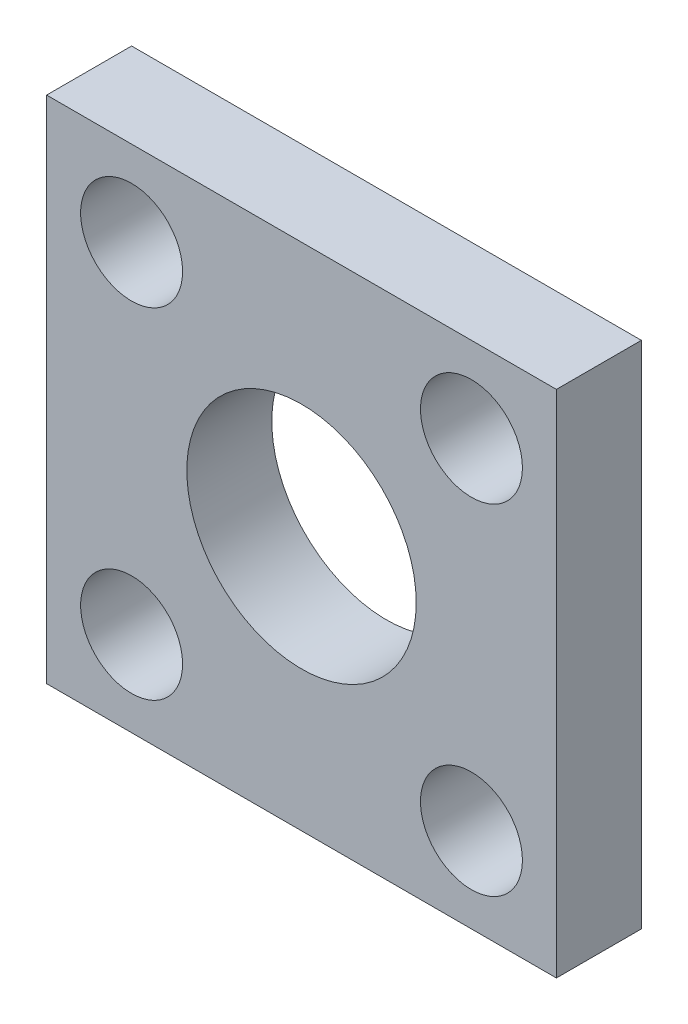
ISO-10303-21;
HEADER;
FILE_DESCRIPTION(('STEP AP214'),'2;1');
FILE_NAME('part.step','',(''),(''),'','','');
FILE_SCHEMA(('AUTOMOTIVE_DESIGN { 1 0 10303 214 1 1 1 1 }'));
ENDSEC;
DATA;
#1=APPLICATION_CONTEXT('core data for automotive mechanical design processes');
#2=APPLICATION_PROTOCOL_DEFINITION('international standard','automotive_design',2000,#1);
#3=PRODUCT_CONTEXT('',#1,'mechanical');
#4=PRODUCT('Part','Part','',(#3));
#5=PRODUCT_RELATED_PRODUCT_CATEGORY('part','',(#4));
#6=PRODUCT_DEFINITION_FORMATION('','',#4);
#7=PRODUCT_DEFINITION_CONTEXT('part definition',#1,'design');
#8=PRODUCT_DEFINITION('design','',#6,#7);
#9=PRODUCT_DEFINITION_SHAPE('','',#8);
#10=(LENGTH_UNIT() NAMED_UNIT(*) SI_UNIT(.MILLI.,.METRE.));
#11=(NAMED_UNIT(*) PLANE_ANGLE_UNIT() SI_UNIT($,.RADIAN.));
#12=(NAMED_UNIT(*) SI_UNIT($,.STERADIAN.) SOLID_ANGLE_UNIT());
#13=UNCERTAINTY_MEASURE_WITH_UNIT(LENGTH_MEASURE(1.E-05),#10,'distance_accuracy_value','');
#14=(GEOMETRIC_REPRESENTATION_CONTEXT(3) GLOBAL_UNCERTAINTY_ASSIGNED_CONTEXT((#13)) GLOBAL_UNIT_ASSIGNED_CONTEXT((#10,
#11,#12)) REPRESENTATION_CONTEXT('',''));
#15=CARTESIAN_POINT('',(0.,0.,0.));
#16=DIRECTION('',(0.,0.,1.));
#17=DIRECTION('',(1.,0.,0.));
#18=AXIS2_PLACEMENT_3D('',#15,#16,#17);
#19=CARTESIAN_POINT('',(0.,0.,10.));
#20=DIRECTION('',(0.,0.,-1.));
#21=DIRECTION('',(-1.,0.,0.));
#22=AXIS2_PLACEMENT_3D('',#19,#20,#21);
#23=PLANE('',#22);
#24=DIRECTION('',(0.,1.,0.));
#25=VECTOR('',#24,1.);
#26=CARTESIAN_POINT('',(30.,-30.,10.));
#27=LINE('',#26,#25);
#28=CARTESIAN_POINT('',(30.,-30.,10.));
#29=VERTEX_POINT('',#28);
#30=CARTESIAN_POINT('',(30.,30.,10.));
#31=VERTEX_POINT('',#30);
#32=EDGE_CURVE('E86',#29,#31,#27,.T.);
#33=ORIENTED_EDGE('',*,*,#32,.T.);
#34=DIRECTION('',(-1.,0.,0.));
#35=VECTOR('',#34,1.);
#36=CARTESIAN_POINT('',(-30.,30.,10.));
#37=LINE('',#36,#35);
#38=CARTESIAN_POINT('',(-30.,30.,10.));
#39=VERTEX_POINT('',#38);
#40=EDGE_CURVE('E81',#31,#39,#37,.T.);
#41=ORIENTED_EDGE('',*,*,#40,.T.);
#42=DIRECTION('',(0.,-1.,0.));
#43=VECTOR('',#42,1.);
#44=CARTESIAN_POINT('',(-30.,-30.,10.));
#45=LINE('',#44,#43);
#46=CARTESIAN_POINT('',(-30.,-30.,10.));
#47=VERTEX_POINT('',#46);
#48=EDGE_CURVE('E84',#39,#47,#45,.T.);
#49=ORIENTED_EDGE('',*,*,#48,.T.);
#50=DIRECTION('',(1.,0.,0.));
#51=VECTOR('',#50,1.);
#52=CARTESIAN_POINT('',(-30.,-30.,10.));
#53=LINE('',#52,#51);
#54=EDGE_CURVE('E51',#47,#29,#53,.T.);
#55=ORIENTED_EDGE('',*,*,#54,.T.);
#56=EDGE_LOOP('',(#33,#41,#49,#55));
#57=FACE_BOUND('',#56,.T.);
#58=CARTESIAN_POINT('',(0.,0.,10.));
#59=DIRECTION('',(0.,0.,1.));
#60=DIRECTION('',(1.,0.,0.));
#61=AXIS2_PLACEMENT_3D('',#58,#59,#60);
#62=CIRCLE('',#61,13.5);
#63=CARTESIAN_POINT('',(13.5,0.,10.));
#64=VERTEX_POINT('',#63);
#65=EDGE_CURVE('E101',#64,#64,#62,.T.);
#66=ORIENTED_EDGE('',*,*,#65,.F.);
#67=EDGE_LOOP('',(#66));
#68=FACE_BOUND('',#67,.T.);
#69=CARTESIAN_POINT('',(-20.,20.,10.));
#70=DIRECTION('',(0.,0.,1.));
#71=DIRECTION('',(1.,0.,0.));
#72=AXIS2_PLACEMENT_3D('',#69,#70,#71);
#73=CIRCLE('',#72,6.);
#74=CARTESIAN_POINT('',(-14.,20.,10.));
#75=VERTEX_POINT('',#74);
#76=EDGE_CURVE('E116',#75,#75,#73,.T.);
#77=ORIENTED_EDGE('',*,*,#76,.F.);
#78=EDGE_LOOP('',(#77));
#79=FACE_BOUND('',#78,.T.);
#80=CARTESIAN_POINT('',(20.,-20.,10.));
#81=DIRECTION('',(0.,0.,1.));
#82=DIRECTION('',(1.,0.,0.));
#83=AXIS2_PLACEMENT_3D('',#80,#81,#82);
#84=CIRCLE('',#83,6.);
#85=CARTESIAN_POINT('',(26.,-20.,10.));
#86=VERTEX_POINT('',#85);
#87=EDGE_CURVE('E122',#86,#86,#84,.T.);
#88=ORIENTED_EDGE('',*,*,#87,.F.);
#89=EDGE_LOOP('',(#88));
#90=FACE_BOUND('',#89,.T.);
#91=CARTESIAN_POINT('',(-20.,-20.,10.));
#92=DIRECTION('',(0.,0.,1.));
#93=DIRECTION('',(1.,0.,0.));
#94=AXIS2_PLACEMENT_3D('',#91,#92,#93);
#95=CIRCLE('',#94,6.);
#96=CARTESIAN_POINT('',(-14.,-20.,10.));
#97=VERTEX_POINT('',#96);
#98=EDGE_CURVE('E128',#97,#97,#95,.T.);
#99=ORIENTED_EDGE('',*,*,#98,.F.);
#100=EDGE_LOOP('',(#99));
#101=FACE_BOUND('',#100,.T.);
#102=CARTESIAN_POINT('',(20.,20.,10.));
#103=DIRECTION('',(0.,0.,1.));
#104=DIRECTION('',(1.,0.,0.));
#105=AXIS2_PLACEMENT_3D('',#102,#103,#104);
#106=CIRCLE('',#105,6.);
#107=CARTESIAN_POINT('',(26.,20.,10.));
#108=VERTEX_POINT('',#107);
#109=EDGE_CURVE('E134',#108,#108,#106,.T.);
#110=ORIENTED_EDGE('',*,*,#109,.F.);
#111=EDGE_LOOP('',(#110));
#112=FACE_BOUND('',#111,.T.);
#113=ADVANCED_FACE('F34',(#57,#68,#79,#90,#101,#112),#23,.F.);
#114=CARTESIAN_POINT('',(0.,0.,0.));
#115=DIRECTION('',(0.,0.,-1.));
#116=DIRECTION('',(-1.,0.,0.));
#117=AXIS2_PLACEMENT_3D('',#114,#115,#116);
#118=PLANE('',#117);
#119=CARTESIAN_POINT('',(-20.,-20.,0.));
#120=DIRECTION('',(0.,0.,1.));
#121=DIRECTION('',(1.,0.,0.));
#122=AXIS2_PLACEMENT_3D('',#119,#120,#121);
#123=CIRCLE('',#122,6.);
#124=CARTESIAN_POINT('',(-14.,-20.,0.));
#125=VERTEX_POINT('',#124);
#126=EDGE_CURVE('E131',#125,#125,#123,.T.);
#127=ORIENTED_EDGE('',*,*,#126,.T.);
#128=EDGE_LOOP('',(#127));
#129=FACE_BOUND('',#128,.T.);
#130=CARTESIAN_POINT('',(-20.,20.,0.));
#131=DIRECTION('',(0.,0.,1.));
#132=DIRECTION('',(1.,0.,0.));
#133=AXIS2_PLACEMENT_3D('',#130,#131,#132);
#134=CIRCLE('',#133,6.);
#135=CARTESIAN_POINT('',(-14.,20.,0.));
#136=VERTEX_POINT('',#135);
#137=EDGE_CURVE('E119',#136,#136,#134,.T.);
#138=ORIENTED_EDGE('',*,*,#137,.T.);
#139=EDGE_LOOP('',(#138));
#140=FACE_BOUND('',#139,.T.);
#141=DIRECTION('',(0.,1.,0.));
#142=VECTOR('',#141,1.);
#143=CARTESIAN_POINT('',(30.,-30.,0.));
#144=LINE('',#143,#142);
#145=CARTESIAN_POINT('',(30.,-30.,0.));
#146=VERTEX_POINT('',#145);
#147=CARTESIAN_POINT('',(30.,30.,0.));
#148=VERTEX_POINT('',#147);
#149=EDGE_CURVE('E98',#146,#148,#144,.T.);
#150=ORIENTED_EDGE('',*,*,#149,.F.);
#151=DIRECTION('',(1.,0.,0.));
#152=VECTOR('',#151,1.);
#153=CARTESIAN_POINT('',(-30.,-30.,0.));
#154=LINE('',#153,#152);
#155=CARTESIAN_POINT('',(-30.,-30.,0.));
#156=VERTEX_POINT('',#155);
#157=EDGE_CURVE('E74',#156,#146,#154,.T.);
#158=ORIENTED_EDGE('',*,*,#157,.F.);
#159=DIRECTION('',(0.,-1.,0.));
#160=VECTOR('',#159,1.);
#161=CARTESIAN_POINT('',(-30.,-30.,0.));
#162=LINE('',#161,#160);
#163=CARTESIAN_POINT('',(-30.,30.,0.));
#164=VERTEX_POINT('',#163);
#165=EDGE_CURVE('E68',#164,#156,#162,.T.);
#166=ORIENTED_EDGE('',*,*,#165,.F.);
#167=DIRECTION('',(-1.,0.,0.));
#168=VECTOR('',#167,1.);
#169=CARTESIAN_POINT('',(-30.,30.,0.));
#170=LINE('',#169,#168);
#171=EDGE_CURVE('E90',#148,#164,#170,.T.);
#172=ORIENTED_EDGE('',*,*,#171,.F.);
#173=EDGE_LOOP('',(#150,#158,#166,#172));
#174=FACE_BOUND('',#173,.T.);
#175=CARTESIAN_POINT('',(0.,0.,0.));
#176=DIRECTION('',(0.,0.,1.));
#177=DIRECTION('',(1.,0.,0.));
#178=AXIS2_PLACEMENT_3D('',#175,#176,#177);
#179=CIRCLE('',#178,13.5);
#180=CARTESIAN_POINT('',(13.5,0.,0.));
#181=VERTEX_POINT('',#180);
#182=EDGE_CURVE('E113',#181,#181,#179,.T.);
#183=ORIENTED_EDGE('',*,*,#182,.T.);
#184=EDGE_LOOP('',(#183));
#185=FACE_BOUND('',#184,.T.);
#186=CARTESIAN_POINT('',(20.,-20.,0.));
#187=DIRECTION('',(0.,0.,1.));
#188=DIRECTION('',(1.,0.,0.));
#189=AXIS2_PLACEMENT_3D('',#186,#187,#188);
#190=CIRCLE('',#189,6.);
#191=CARTESIAN_POINT('',(26.,-20.,0.));
#192=VERTEX_POINT('',#191);
#193=EDGE_CURVE('E125',#192,#192,#190,.T.);
#194=ORIENTED_EDGE('',*,*,#193,.T.);
#195=EDGE_LOOP('',(#194));
#196=FACE_BOUND('',#195,.T.);
#197=CARTESIAN_POINT('',(20.,20.,0.));
#198=DIRECTION('',(0.,0.,1.));
#199=DIRECTION('',(1.,0.,0.));
#200=AXIS2_PLACEMENT_3D('',#197,#198,#199);
#201=CIRCLE('',#200,6.);
#202=CARTESIAN_POINT('',(26.,20.,0.));
#203=VERTEX_POINT('',#202);
#204=EDGE_CURVE('E137',#203,#203,#201,.T.);
#205=ORIENTED_EDGE('',*,*,#204,.T.);
#206=EDGE_LOOP('',(#205));
#207=FACE_BOUND('',#206,.T.);
#208=ADVANCED_FACE('F109',(#129,#140,#174,#185,#196,#207),#118,.T.);
#209=CARTESIAN_POINT('',(30.,-30.,10.));
#210=DIRECTION('',(-1.,0.,0.));
#211=DIRECTION('',(0.,0.,1.));
#212=AXIS2_PLACEMENT_3D('',#209,#210,#211);
#213=PLANE('',#212);
#214=ORIENTED_EDGE('',*,*,#149,.T.);
#215=DIRECTION('',(0.,0.,-1.));
#216=VECTOR('',#215,1.);
#217=CARTESIAN_POINT('',(30.,30.,10.));
#218=LINE('',#217,#216);
#219=EDGE_CURVE('E11',#31,#148,#218,.T.);
#220=ORIENTED_EDGE('',*,*,#219,.F.);
#221=ORIENTED_EDGE('',*,*,#32,.F.);
#222=DIRECTION('',(0.,0.,-1.));
#223=VECTOR('',#222,1.);
#224=CARTESIAN_POINT('',(30.,-30.,10.));
#225=LINE('',#224,#223);
#226=EDGE_CURVE('E94',#29,#146,#225,.T.);
#227=ORIENTED_EDGE('',*,*,#226,.T.);
#228=EDGE_LOOP('',(#214,#220,#221,#227));
#229=FACE_BOUND('',#228,.T.);
#230=ADVANCED_FACE('F36',(#229),#213,.F.);
#231=CARTESIAN_POINT('',(-30.,30.,10.));
#232=DIRECTION('',(0.,-1.,0.));
#233=DIRECTION('',(0.,0.,-1.));
#234=AXIS2_PLACEMENT_3D('',#231,#232,#233);
#235=PLANE('',#234);
#236=ORIENTED_EDGE('',*,*,#171,.T.);
#237=DIRECTION('',(0.,0.,-1.));
#238=VECTOR('',#237,1.);
#239=CARTESIAN_POINT('',(-30.,30.,10.));
#240=LINE('',#239,#238);
#241=EDGE_CURVE('E43',#39,#164,#240,.T.);
#242=ORIENTED_EDGE('',*,*,#241,.F.);
#243=ORIENTED_EDGE('',*,*,#40,.F.);
#244=ORIENTED_EDGE('',*,*,#219,.T.);
#245=EDGE_LOOP('',(#236,#242,#243,#244));
#246=FACE_BOUND('',#245,.T.);
#247=ADVANCED_FACE('F89',(#246),#235,.F.);
#248=CARTESIAN_POINT('',(-30.,-30.,10.));
#249=DIRECTION('',(1.,0.,0.));
#250=DIRECTION('',(0.,0.,-1.));
#251=AXIS2_PLACEMENT_3D('',#248,#249,#250);
#252=PLANE('',#251);
#253=ORIENTED_EDGE('',*,*,#165,.T.);
#254=DIRECTION('',(0.,0.,-1.));
#255=VECTOR('',#254,1.);
#256=CARTESIAN_POINT('',(-30.,-30.,10.));
#257=LINE('',#256,#255);
#258=EDGE_CURVE('E91',#47,#156,#257,.T.);
#259=ORIENTED_EDGE('',*,*,#258,.F.);
#260=ORIENTED_EDGE('',*,*,#48,.F.);
#261=ORIENTED_EDGE('',*,*,#241,.T.);
#262=EDGE_LOOP('',(#253,#259,#260,#261));
#263=FACE_BOUND('',#262,.T.);
#264=ADVANCED_FACE('F92',(#263),#252,.F.);
#265=CARTESIAN_POINT('',(-30.,-30.,10.));
#266=DIRECTION('',(0.,1.,0.));
#267=DIRECTION('',(0.,0.,1.));
#268=AXIS2_PLACEMENT_3D('',#265,#266,#267);
#269=PLANE('',#268);
#270=ORIENTED_EDGE('',*,*,#157,.T.);
#271=ORIENTED_EDGE('',*,*,#226,.F.);
#272=ORIENTED_EDGE('',*,*,#54,.F.);
#273=ORIENTED_EDGE('',*,*,#258,.T.);
#274=EDGE_LOOP('',(#270,#271,#272,#273));
#275=FACE_BOUND('',#274,.T.);
#276=ADVANCED_FACE('F106',(#275),#269,.F.);
#277=CARTESIAN_POINT('',(0.,0.,10.));
#278=DIRECTION('',(0.,0.,-1.));
#279=DIRECTION('',(-1.,0.,0.));
#280=AXIS2_PLACEMENT_3D('',#277,#278,#279);
#281=CYLINDRICAL_SURFACE('',#280,13.5);
#282=ORIENTED_EDGE('',*,*,#65,.T.);
#283=EDGE_LOOP('',(#282));
#284=FACE_BOUND('',#283,.T.);
#285=ORIENTED_EDGE('',*,*,#182,.F.);
#286=EDGE_LOOP('',(#285));
#287=FACE_BOUND('',#286,.T.);
#288=ADVANCED_FACE('F154',(#284,#287),#281,.F.);
#289=CARTESIAN_POINT('',(-20.,20.,10.));
#290=DIRECTION('',(0.,0.,-1.));
#291=DIRECTION('',(-1.,0.,0.));
#292=AXIS2_PLACEMENT_3D('',#289,#290,#291);
#293=CYLINDRICAL_SURFACE('',#292,6.);
#294=ORIENTED_EDGE('',*,*,#76,.T.);
#295=EDGE_LOOP('',(#294));
#296=FACE_BOUND('',#295,.T.);
#297=ORIENTED_EDGE('',*,*,#137,.F.);
#298=EDGE_LOOP('',(#297));
#299=FACE_BOUND('',#298,.T.);
#300=ADVANCED_FACE('F200',(#296,#299),#293,.F.);
#301=CARTESIAN_POINT('',(20.,-20.,10.));
#302=DIRECTION('',(0.,0.,-1.));
#303=DIRECTION('',(-1.,0.,0.));
#304=AXIS2_PLACEMENT_3D('',#301,#302,#303);
#305=CYLINDRICAL_SURFACE('',#304,6.);
#306=ORIENTED_EDGE('',*,*,#87,.T.);
#307=EDGE_LOOP('',(#306));
#308=FACE_BOUND('',#307,.T.);
#309=ORIENTED_EDGE('',*,*,#193,.F.);
#310=EDGE_LOOP('',(#309));
#311=FACE_BOUND('',#310,.T.);
#312=ADVANCED_FACE('F208',(#308,#311),#305,.F.);
#313=CARTESIAN_POINT('',(-20.,-20.,10.));
#314=DIRECTION('',(0.,0.,-1.));
#315=DIRECTION('',(-1.,0.,0.));
#316=AXIS2_PLACEMENT_3D('',#313,#314,#315);
#317=CYLINDRICAL_SURFACE('',#316,6.);
#318=ORIENTED_EDGE('',*,*,#98,.T.);
#319=EDGE_LOOP('',(#318));
#320=FACE_BOUND('',#319,.T.);
#321=ORIENTED_EDGE('',*,*,#126,.F.);
#322=EDGE_LOOP('',(#321));
#323=FACE_BOUND('',#322,.T.);
#324=ADVANCED_FACE('F216',(#320,#323),#317,.F.);
#325=CARTESIAN_POINT('',(20.,20.,10.));
#326=DIRECTION('',(0.,0.,-1.));
#327=DIRECTION('',(-1.,0.,0.));
#328=AXIS2_PLACEMENT_3D('',#325,#326,#327);
#329=CYLINDRICAL_SURFACE('',#328,6.);
#330=ORIENTED_EDGE('',*,*,#109,.T.);
#331=EDGE_LOOP('',(#330));
#332=FACE_BOUND('',#331,.T.);
#333=ORIENTED_EDGE('',*,*,#204,.F.);
#334=EDGE_LOOP('',(#333));
#335=FACE_BOUND('',#334,.T.);
#336=ADVANCED_FACE('F143',(#332,#335),#329,.F.);
#337=CLOSED_SHELL('',(#113,#208,#230,#247,#264,#276,#288,#300,#312,#324,#336));
#338=MANIFOLD_SOLID_BREP('B2',#337);
#339=ADVANCED_BREP_SHAPE_REPRESENTATION('',(#18,#338),#14);
#340=SHAPE_DEFINITION_REPRESENTATION(#9,#339);
ENDSEC;
END-ISO-10303-21;
